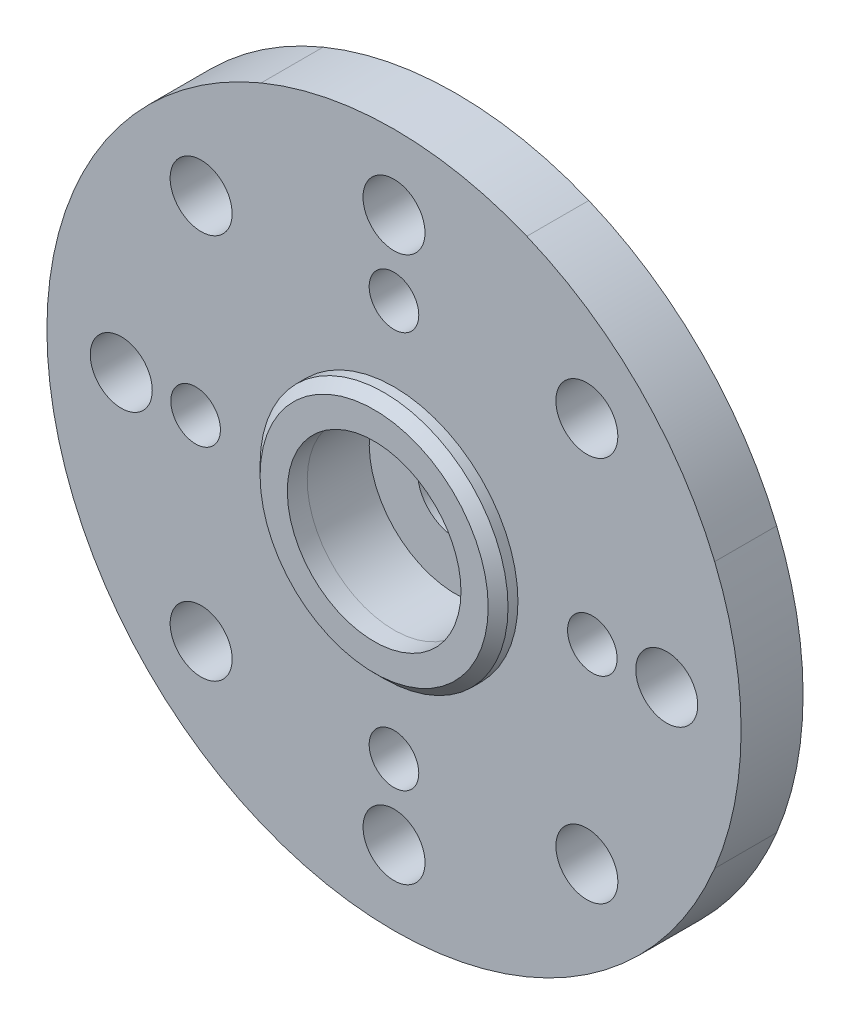
ISO-10303-21;
HEADER;
FILE_DESCRIPTION(('STEP AP214'),'2;1');
FILE_NAME('part.step','',(''),(''),'','','');
FILE_SCHEMA(('AUTOMOTIVE_DESIGN { 1 0 10303 214 1 1 1 1 }'));
ENDSEC;
DATA;
#1=APPLICATION_CONTEXT('core data for automotive mechanical design processes');
#2=APPLICATION_PROTOCOL_DEFINITION('international standard','automotive_design',2000,#1);
#3=PRODUCT_CONTEXT('',#1,'mechanical');
#4=PRODUCT('Part','Part','',(#3));
#5=PRODUCT_RELATED_PRODUCT_CATEGORY('part','',(#4));
#6=PRODUCT_DEFINITION_FORMATION('','',#4);
#7=PRODUCT_DEFINITION_CONTEXT('part definition',#1,'design');
#8=PRODUCT_DEFINITION('design','',#6,#7);
#9=PRODUCT_DEFINITION_SHAPE('','',#8);
#10=(LENGTH_UNIT() NAMED_UNIT(*) SI_UNIT(.MILLI.,.METRE.));
#11=(NAMED_UNIT(*) PLANE_ANGLE_UNIT() SI_UNIT($,.RADIAN.));
#12=(NAMED_UNIT(*) SI_UNIT($,.STERADIAN.) SOLID_ANGLE_UNIT());
#13=UNCERTAINTY_MEASURE_WITH_UNIT(LENGTH_MEASURE(1.E-05),#10,'distance_accuracy_value','');
#14=(GEOMETRIC_REPRESENTATION_CONTEXT(3) GLOBAL_UNCERTAINTY_ASSIGNED_CONTEXT((#13)) GLOBAL_UNIT_ASSIGNED_CONTEXT((#10,
#11,#12)) REPRESENTATION_CONTEXT('',''));
#15=CARTESIAN_POINT('',(0.,0.,0.));
#16=DIRECTION('',(0.,0.,1.));
#17=DIRECTION('',(1.,0.,0.));
#18=AXIS2_PLACEMENT_3D('',#15,#16,#17);
#19=CARTESIAN_POINT('',(0.,0.,0.));
#20=DIRECTION('',(0.,0.,1.));
#21=DIRECTION('',(1.,0.,0.));
#22=AXIS2_PLACEMENT_3D('',#19,#20,#21);
#23=PLANE('',#22);
#24=CARTESIAN_POINT('',(-10.9989999545496,-0.00099995454132478,0.));
#25=DIRECTION('',(0.,0.,1.));
#26=DIRECTION('',(1.,0.,0.));
#27=AXIS2_PLACEMENT_3D('',#24,#25,#26);
#28=CIRCLE('',#27,1.25);
#29=CARTESIAN_POINT('',(-9.74899995454959,-0.00099995454132478,0.));
#30=VERTEX_POINT('',#29);
#31=EDGE_CURVE('E197',#30,#30,#28,.T.);
#32=ORIENTED_EDGE('',*,*,#31,.T.);
#33=EDGE_LOOP('',(#32));
#34=FACE_BOUND('',#33,.T.);
#35=CARTESIAN_POINT('',(-7.77646745413667,-7.77888162223453,0.));
#36=DIRECTION('',(0.,0.,1.));
#37=DIRECTION('',(1.,0.,0.));
#38=AXIS2_PLACEMENT_3D('',#35,#36,#37);
#39=CIRCLE('',#38,1.25);
#40=CARTESIAN_POINT('',(-6.52646745413667,-7.77888162223453,0.));
#41=VERTEX_POINT('',#40);
#42=EDGE_CURVE('E194',#41,#41,#39,.T.);
#43=ORIENTED_EDGE('',*,*,#42,.T.);
#44=EDGE_LOOP('',(#43));
#45=FACE_BOUND('',#44,.T.);
#46=CARTESIAN_POINT('',(-7.7778816676932,7.77746749958708,0.));
#47=DIRECTION('',(0.,0.,1.));
#48=DIRECTION('',(1.,0.,0.));
#49=AXIS2_PLACEMENT_3D('',#46,#47,#48);
#50=CIRCLE('',#49,1.25);
#51=CARTESIAN_POINT('',(-6.5278816676932,7.77746749958708,0.));
#52=VERTEX_POINT('',#51);
#53=EDGE_CURVE('E191',#52,#52,#50,.T.);
#54=ORIENTED_EDGE('',*,*,#53,.T.);
#55=EDGE_LOOP('',(#54));
#56=FACE_BOUND('',#55,.T.);
#57=CARTESIAN_POINT('',(-7.99999999999981,-1.95040837110594E-13,0.));
#58=DIRECTION('',(0.,0.,1.));
#59=DIRECTION('',(1.,0.,0.));
#60=AXIS2_PLACEMENT_3D('',#57,#58,#59);
#61=CIRCLE('',#60,1.);
#62=CARTESIAN_POINT('',(-6.99999999999981,-1.95040837110594E-13,0.));
#63=VERTEX_POINT('',#62);
#64=EDGE_CURVE('E188',#63,#63,#61,.T.);
#65=ORIENTED_EDGE('',*,*,#64,.T.);
#66=EDGE_LOOP('',(#65));
#67=FACE_BOUND('',#66,.T.);
#68=CARTESIAN_POINT('',(0.00100004545041241,-0.000999954541323126,0.));
#69=DIRECTION('',(0.,0.,1.));
#70=DIRECTION('',(1.,0.,0.));
#71=AXIS2_PLACEMENT_3D('',#68,#69,#70);
#72=CIRCLE('',#71,14.);
#73=CARTESIAN_POINT('',(5.35762660762039,12.9337034387899,0.));
#74=VERTEX_POINT('',#73);
#75=CARTESIAN_POINT('',(-5.35666620819831,12.9332728241855,0.));
#76=VERTEX_POINT('',#75);
#77=EDGE_CURVE('E174',#74,#76,#72,.T.);
#78=ORIENTED_EDGE('',*,*,#77,.F.);
#79=CARTESIAN_POINT('',(0.000292925358819902,-0.000707093464936729,0.));
#80=DIRECTION('',(0.,0.,1.));
#81=DIRECTION('',(1.,0.,0.));
#82=AXIS2_PLACEMENT_3D('',#79,#80,#81);
#83=CIRCLE('',#82,14.);
#84=CARTESIAN_POINT('',(12.9342163738387,5.35780242214324,0.));
#85=VERTEX_POINT('',#84);
#86=EDGE_CURVE('E87',#85,#74,#83,.T.);
#87=ORIENTED_EDGE('',*,*,#86,.F.);
#88=CARTESIAN_POINT('',(0.,0.,0.));
#89=DIRECTION('',(0.,0.,1.));
#90=DIRECTION('',(1.,0.,0.));
#91=AXIS2_PLACEMENT_3D('',#88,#89,#90);
#92=CIRCLE('',#91,14.);
#93=CARTESIAN_POINT('',(12.9347033933191,-5.3566265621993,0.));
#94=VERTEX_POINT('',#93);
#95=EDGE_CURVE('E81',#94,#85,#92,.T.);
#96=ORIENTED_EDGE('',*,*,#95,.F.);
#97=CARTESIAN_POINT('',(0.000292861076386398,0.000707120091592508,0.));
#98=DIRECTION('',(0.,0.,1.));
#99=DIRECTION('',(1.,0.,0.));
#100=AXIS2_PLACEMENT_3D('',#97,#98,#99);
#101=CIRCLE('',#100,14.);
#102=CARTESIAN_POINT('',(5.35880237671388,-12.9332163283761,0.));
#103=VERTEX_POINT('',#102);
#104=EDGE_CURVE('E124',#103,#94,#101,.T.);
#105=ORIENTED_EDGE('',*,*,#104,.F.);
#106=CARTESIAN_POINT('',(0.000999954541323126,0.00100004545041241,0.));
#107=DIRECTION('',(0.,0.,1.));
#108=DIRECTION('',(1.,0.,0.));
#109=AXIS2_PLACEMENT_3D('',#106,#107,#108);
#110=CIRCLE('',#109,14.);
#111=CARTESIAN_POINT('',(-5.35562660765797,-12.9337033478687,0.));
#112=VERTEX_POINT('',#111);
#113=EDGE_CURVE('E183',#112,#103,#110,.T.);
#114=ORIENTED_EDGE('',*,*,#113,.F.);
#115=CARTESIAN_POINT('',(0.00170707463291564,0.000707184374026013,0.));
#116=DIRECTION('',(0.,0.,1.));
#117=DIRECTION('',(1.,0.,0.));
#118=AXIS2_PLACEMENT_3D('',#115,#116,#117);
#119=CIRCLE('',#118,14.);
#120=CARTESIAN_POINT('',(-12.9322163738348,-5.35780233126346,0.));
#121=VERTEX_POINT('',#120);
#122=EDGE_CURVE('E181',#121,#112,#119,.T.);
#123=ORIENTED_EDGE('',*,*,#122,.F.);
#124=CARTESIAN_POINT('',(0.00199999999173554,9.09090892843415E-08,0.));
#125=DIRECTION('',(0.,0.,1.));
#126=DIRECTION('',(1.,0.,0.));
#127=AXIS2_PLACEMENT_3D('',#124,#125,#126);
#128=CIRCLE('',#127,14.);
#129=CARTESIAN_POINT('',(-12.9327597858485,5.35649047945739,0.));
#130=VERTEX_POINT('',#129);
#131=EDGE_CURVE('E179',#130,#121,#128,.T.);
#132=ORIENTED_EDGE('',*,*,#131,.F.);
#133=CARTESIAN_POINT('',(0.00170713891534914,-0.000707029182503224,0.));
#134=DIRECTION('',(0.,0.,1.));
#135=DIRECTION('',(1.,0.,0.));
#136=AXIS2_PLACEMENT_3D('',#133,#134,#135);
#137=CIRCLE('',#136,13.9999999919424);
#138=EDGE_CURVE('E177',#76,#130,#137,.T.);
#139=ORIENTED_EDGE('',*,*,#138,.F.);
#140=EDGE_LOOP('',(#78,#87,#96,#105,#114,#123,#132,#139));
#141=FACE_BOUND('',#140,.T.);
#142=CARTESIAN_POINT('',(8.00000000000019,1.94061119671276E-13,0.));
#143=DIRECTION('',(0.,0.,1.));
#144=DIRECTION('',(1.,0.,0.));
#145=AXIS2_PLACEMENT_3D('',#142,#143,#144);
#146=CIRCLE('',#145,1.);
#147=CARTESIAN_POINT('',(9.0000000000002,1.94061119671276E-13,0.));
#148=VERTEX_POINT('',#147);
#149=EDGE_CURVE('E171',#148,#148,#146,.T.);
#150=ORIENTED_EDGE('',*,*,#149,.T.);
#151=EDGE_LOOP('',(#150));
#152=FACE_BOUND('',#151,.T.);
#153=CARTESIAN_POINT('',(7.77988166768494,-7.777467408678,0.));
#154=DIRECTION('',(0.,0.,1.));
#155=DIRECTION('',(1.,0.,0.));
#156=AXIS2_PLACEMENT_3D('',#153,#154,#155);
#157=CIRCLE('',#156,1.25000000805759);
#158=CARTESIAN_POINT('',(9.02988167574254,-7.777467408678,0.));
#159=VERTEX_POINT('',#158);
#160=EDGE_CURVE('E168',#159,#159,#157,.T.);
#161=ORIENTED_EDGE('',*,*,#160,.T.);
#162=EDGE_LOOP('',(#161));
#163=FACE_BOUND('',#162,.T.);
#164=CARTESIAN_POINT('',(7.77846745412841,7.77888171314361,0.));
#165=DIRECTION('',(0.,0.,1.));
#166=DIRECTION('',(1.,0.,0.));
#167=AXIS2_PLACEMENT_3D('',#164,#165,#166);
#168=CIRCLE('',#167,1.25);
#169=CARTESIAN_POINT('',(9.02846745412841,7.77888171314361,0.));
#170=VERTEX_POINT('',#169);
#171=EDGE_CURVE('E165',#170,#170,#168,.T.);
#172=ORIENTED_EDGE('',*,*,#171,.T.);
#173=EDGE_LOOP('',(#172));
#174=FACE_BOUND('',#173,.T.);
#175=CARTESIAN_POINT('',(11.0009999545413,0.00100004545041272,0.));
#176=DIRECTION('',(0.,0.,1.));
#177=DIRECTION('',(1.,0.,0.));
#178=AXIS2_PLACEMENT_3D('',#175,#176,#177);
#179=CIRCLE('',#178,1.25);
#180=CARTESIAN_POINT('',(12.2509999545413,0.00100004545041272,0.));
#181=VERTEX_POINT('',#180);
#182=EDGE_CURVE('E162',#181,#181,#179,.T.);
#183=ORIENTED_EDGE('',*,*,#182,.T.);
#184=EDGE_LOOP('',(#183));
#185=FACE_BOUND('',#184,.T.);
#186=CARTESIAN_POINT('',(0.00199999999173652,-10.9999999090909,0.));
#187=DIRECTION('',(0.,0.,1.));
#188=DIRECTION('',(1.,0.,0.));
#189=AXIS2_PLACEMENT_3D('',#186,#187,#188);
#190=CIRCLE('',#189,1.25);
#191=CARTESIAN_POINT('',(1.25199999999174,-10.9999999090909,0.));
#192=VERTEX_POINT('',#191);
#193=EDGE_CURVE('E159',#192,#192,#190,.T.);
#194=ORIENTED_EDGE('',*,*,#193,.T.);
#195=EDGE_LOOP('',(#194));
#196=FACE_BOUND('',#195,.T.);
#197=CARTESIAN_POINT('',(3.8885702742204E-13,-8.,0.));
#198=DIRECTION('',(0.,0.,1.));
#199=DIRECTION('',(1.,0.,0.));
#200=AXIS2_PLACEMENT_3D('',#197,#198,#199);
#201=CIRCLE('',#200,1.);
#202=CARTESIAN_POINT('',(1.00000000000039,-8.,0.));
#203=VERTEX_POINT('',#202);
#204=EDGE_CURVE('E156',#203,#203,#201,.T.);
#205=ORIENTED_EDGE('',*,*,#204,.T.);
#206=EDGE_LOOP('',(#205));
#207=FACE_BOUND('',#206,.T.);
#208=CARTESIAN_POINT('',(0.,8.,0.));
#209=DIRECTION('',(0.,0.,1.));
#210=DIRECTION('',(1.,0.,0.));
#211=AXIS2_PLACEMENT_3D('',#208,#209,#210);
#212=CIRCLE('',#211,1.);
#213=CARTESIAN_POINT('',(1.,8.,0.));
#214=VERTEX_POINT('',#213);
#215=EDGE_CURVE('E149',#214,#214,#212,.T.);
#216=ORIENTED_EDGE('',*,*,#215,.T.);
#217=EDGE_LOOP('',(#216));
#218=FACE_BOUND('',#217,.T.);
#219=CARTESIAN_POINT('',(0.,11.,0.));
#220=DIRECTION('',(0.,0.,1.));
#221=DIRECTION('',(1.,0.,0.));
#222=AXIS2_PLACEMENT_3D('',#219,#220,#221);
#223=CIRCLE('',#222,1.25);
#224=CARTESIAN_POINT('',(1.25,11.,0.));
#225=VERTEX_POINT('',#224);
#226=EDGE_CURVE('E146',#225,#225,#223,.T.);
#227=ORIENTED_EDGE('',*,*,#226,.T.);
#228=EDGE_LOOP('',(#227));
#229=FACE_BOUND('',#228,.T.);
#230=CARTESIAN_POINT('',(0.,0.,0.));
#231=DIRECTION('',(0.,0.,1.));
#232=DIRECTION('',(1.,0.,0.));
#233=AXIS2_PLACEMENT_3D('',#230,#231,#232);
#234=CIRCLE('',#233,5.);
#235=CARTESIAN_POINT('',(5.,0.,0.));
#236=VERTEX_POINT('',#235);
#237=EDGE_CURVE('E215',#236,#236,#234,.F.);
#238=ORIENTED_EDGE('',*,*,#237,.F.);
#239=EDGE_LOOP('',(#238));
#240=FACE_BOUND('',#239,.T.);
#241=ADVANCED_FACE('F35',(#34,#45,#56,#67,#141,#152,#163,#174,#185,#196,#207,#218,#229,#240),
#23,.F.);
#242=CARTESIAN_POINT('',(0.00100004545041241,-0.000999954541323126,2.5));
#243=DIRECTION('',(0.,0.,-1.));
#244=DIRECTION('',(-1.,0.,0.));
#245=AXIS2_PLACEMENT_3D('',#242,#243,#244);
#246=CYLINDRICAL_SURFACE('',#245,14.);
#247=ORIENTED_EDGE('',*,*,#77,.T.);
#248=DIRECTION('',(0.,0.,-1.));
#249=VECTOR('',#248,1.);
#250=CARTESIAN_POINT('',(-5.35666620819831,12.9332728241855,2.5));
#251=LINE('',#250,#249);
#252=CARTESIAN_POINT('',(-5.35666620819831,12.9332728241855,2.5));
#253=VERTEX_POINT('',#252);
#254=EDGE_CURVE('E213',#253,#76,#251,.T.);
#255=ORIENTED_EDGE('',*,*,#254,.F.);
#256=CARTESIAN_POINT('',(0.00100004545041241,-0.000999954541323126,2.5));
#257=DIRECTION('',(0.,0.,1.));
#258=DIRECTION('',(1.,0.,0.));
#259=AXIS2_PLACEMENT_3D('',#256,#257,#258);
#260=CIRCLE('',#259,14.);
#261=CARTESIAN_POINT('',(5.35762660762039,12.9337034387899,2.5));
#262=VERTEX_POINT('',#261);
#263=EDGE_CURVE('E408',#262,#253,#260,.T.);
#264=ORIENTED_EDGE('',*,*,#263,.F.);
#265=DIRECTION('',(0.,0.,-1.));
#266=VECTOR('',#265,1.);
#267=CARTESIAN_POINT('',(5.35762660762039,12.9337034387899,2.5));
#268=LINE('',#267,#266);
#269=EDGE_CURVE('E145',#262,#74,#268,.T.);
#270=ORIENTED_EDGE('',*,*,#269,.T.);
#271=EDGE_LOOP('',(#247,#255,#264,#270));
#272=FACE_BOUND('',#271,.T.);
#273=ADVANCED_FACE('F254',(#272),#246,.T.);
#274=CARTESIAN_POINT('',(0.00170713891534914,-0.000707029182503224,2.5));
#275=DIRECTION('',(0.,0.,-1.));
#276=DIRECTION('',(-1.,0.,0.));
#277=AXIS2_PLACEMENT_3D('',#274,#275,#276);
#278=CYLINDRICAL_SURFACE('',#277,13.9999999919424);
#279=ORIENTED_EDGE('',*,*,#138,.T.);
#280=DIRECTION('',(0.,0.,-1.));
#281=VECTOR('',#280,1.);
#282=CARTESIAN_POINT('',(-12.9327597858485,5.35649047945739,2.5));
#283=LINE('',#282,#281);
#284=CARTESIAN_POINT('',(-12.9327597858485,5.35649047945739,2.5));
#285=VERTEX_POINT('',#284);
#286=EDGE_CURVE('E210',#285,#130,#283,.T.);
#287=ORIENTED_EDGE('',*,*,#286,.F.);
#288=CARTESIAN_POINT('',(0.00170713891534914,-0.000707029182503224,2.5));
#289=DIRECTION('',(0.,0.,1.));
#290=DIRECTION('',(1.,0.,0.));
#291=AXIS2_PLACEMENT_3D('',#288,#289,#290);
#292=CIRCLE('',#291,13.9999999919424);
#293=EDGE_CURVE('E96',#253,#285,#292,.T.);
#294=ORIENTED_EDGE('',*,*,#293,.F.);
#295=ORIENTED_EDGE('',*,*,#254,.T.);
#296=EDGE_LOOP('',(#279,#287,#294,#295));
#297=FACE_BOUND('',#296,.T.);
#298=ADVANCED_FACE('F260',(#297),#278,.T.);
#299=CARTESIAN_POINT('',(0.00199999999173554,9.09090892843415E-08,2.5));
#300=DIRECTION('',(0.,0.,-1.));
#301=DIRECTION('',(-1.,0.,0.));
#302=AXIS2_PLACEMENT_3D('',#299,#300,#301);
#303=CYLINDRICAL_SURFACE('',#302,14.);
#304=ORIENTED_EDGE('',*,*,#131,.T.);
#305=DIRECTION('',(0.,0.,-1.));
#306=VECTOR('',#305,1.);
#307=CARTESIAN_POINT('',(-12.9322163738348,-5.35780233126346,2.5));
#308=LINE('',#307,#306);
#309=CARTESIAN_POINT('',(-12.9322163738348,-5.35780233126346,2.5));
#310=VERTEX_POINT('',#309);
#311=EDGE_CURVE('E207',#310,#121,#308,.T.);
#312=ORIENTED_EDGE('',*,*,#311,.F.);
#313=CARTESIAN_POINT('',(0.00199999999173554,9.09090892843415E-08,2.5));
#314=DIRECTION('',(0.,0.,1.));
#315=DIRECTION('',(1.,0.,0.));
#316=AXIS2_PLACEMENT_3D('',#313,#314,#315);
#317=CIRCLE('',#316,14.);
#318=EDGE_CURVE('E411',#285,#310,#317,.T.);
#319=ORIENTED_EDGE('',*,*,#318,.F.);
#320=ORIENTED_EDGE('',*,*,#286,.T.);
#321=EDGE_LOOP('',(#304,#312,#319,#320));
#322=FACE_BOUND('',#321,.T.);
#323=ADVANCED_FACE('F294',(#322),#303,.T.);
#324=CARTESIAN_POINT('',(0.00170707463291564,0.000707184374026013,2.5));
#325=DIRECTION('',(0.,0.,-1.));
#326=DIRECTION('',(-1.,0.,0.));
#327=AXIS2_PLACEMENT_3D('',#324,#325,#326);
#328=CYLINDRICAL_SURFACE('',#327,14.);
#329=ORIENTED_EDGE('',*,*,#122,.T.);
#330=DIRECTION('',(0.,0.,-1.));
#331=VECTOR('',#330,1.);
#332=CARTESIAN_POINT('',(-5.35562660765797,-12.9337033478687,2.5));
#333=LINE('',#332,#331);
#334=CARTESIAN_POINT('',(-5.35562660765797,-12.9337033478687,2.5));
#335=VERTEX_POINT('',#334);
#336=EDGE_CURVE('E204',#335,#112,#333,.T.);
#337=ORIENTED_EDGE('',*,*,#336,.F.);
#338=CARTESIAN_POINT('',(0.00170707463291564,0.000707184374026013,2.5));
#339=DIRECTION('',(0.,0.,1.));
#340=DIRECTION('',(1.,0.,0.));
#341=AXIS2_PLACEMENT_3D('',#338,#339,#340);
#342=CIRCLE('',#341,14.);
#343=EDGE_CURVE('E413',#310,#335,#342,.T.);
#344=ORIENTED_EDGE('',*,*,#343,.F.);
#345=ORIENTED_EDGE('',*,*,#311,.T.);
#346=EDGE_LOOP('',(#329,#337,#344,#345));
#347=FACE_BOUND('',#346,.T.);
#348=ADVANCED_FACE('F290',(#347),#328,.T.);
#349=CARTESIAN_POINT('',(0.000999954541323126,0.00100004545041241,2.5));
#350=DIRECTION('',(0.,0.,-1.));
#351=DIRECTION('',(-1.,0.,0.));
#352=AXIS2_PLACEMENT_3D('',#349,#350,#351);
#353=CYLINDRICAL_SURFACE('',#352,14.);
#354=ORIENTED_EDGE('',*,*,#113,.T.);
#355=DIRECTION('',(0.,0.,-1.));
#356=VECTOR('',#355,1.);
#357=CARTESIAN_POINT('',(5.35880237671388,-12.9332163283761,2.5));
#358=LINE('',#357,#356);
#359=CARTESIAN_POINT('',(5.35880237671388,-12.9332163283761,2.5));
#360=VERTEX_POINT('',#359);
#361=EDGE_CURVE('E125',#360,#103,#358,.T.);
#362=ORIENTED_EDGE('',*,*,#361,.F.);
#363=CARTESIAN_POINT('',(0.000999954541323126,0.00100004545041241,2.5));
#364=DIRECTION('',(0.,0.,1.));
#365=DIRECTION('',(1.,0.,0.));
#366=AXIS2_PLACEMENT_3D('',#363,#364,#365);
#367=CIRCLE('',#366,14.);
#368=EDGE_CURVE('E116',#335,#360,#367,.T.);
#369=ORIENTED_EDGE('',*,*,#368,.F.);
#370=ORIENTED_EDGE('',*,*,#336,.T.);
#371=EDGE_LOOP('',(#354,#362,#369,#370));
#372=FACE_BOUND('',#371,.T.);
#373=ADVANCED_FACE('F287',(#372),#353,.T.);
#374=CARTESIAN_POINT('',(0.000292861076386398,0.000707120091592508,2.5));
#375=DIRECTION('',(0.,0.,-1.));
#376=DIRECTION('',(-1.,0.,0.));
#377=AXIS2_PLACEMENT_3D('',#374,#375,#376);
#378=CYLINDRICAL_SURFACE('',#377,14.);
#379=ORIENTED_EDGE('',*,*,#104,.T.);
#380=DIRECTION('',(0.,0.,-1.));
#381=VECTOR('',#380,1.);
#382=CARTESIAN_POINT('',(12.9347033933191,-5.3566265621993,2.5));
#383=LINE('',#382,#381);
#384=CARTESIAN_POINT('',(12.9347033933191,-5.3566265621993,2.5));
#385=VERTEX_POINT('',#384);
#386=EDGE_CURVE('E121',#385,#94,#383,.T.);
#387=ORIENTED_EDGE('',*,*,#386,.F.);
#388=CARTESIAN_POINT('',(0.000292861076386398,0.000707120091592508,2.5));
#389=DIRECTION('',(0.,0.,1.));
#390=DIRECTION('',(1.,0.,0.));
#391=AXIS2_PLACEMENT_3D('',#388,#389,#390);
#392=CIRCLE('',#391,14.);
#393=EDGE_CURVE('E109',#360,#385,#392,.T.);
#394=ORIENTED_EDGE('',*,*,#393,.F.);
#395=ORIENTED_EDGE('',*,*,#361,.T.);
#396=EDGE_LOOP('',(#379,#387,#394,#395));
#397=FACE_BOUND('',#396,.T.);
#398=ADVANCED_FACE('F122',(#397),#378,.T.);
#399=CARTESIAN_POINT('',(0.,0.,2.5));
#400=DIRECTION('',(0.,0.,-1.));
#401=DIRECTION('',(-1.,0.,0.));
#402=AXIS2_PLACEMENT_3D('',#399,#400,#401);
#403=CYLINDRICAL_SURFACE('',#402,14.);
#404=ORIENTED_EDGE('',*,*,#95,.T.);
#405=DIRECTION('',(0.,0.,-1.));
#406=VECTOR('',#405,1.);
#407=CARTESIAN_POINT('',(12.9342163738387,5.35780242214324,2.5));
#408=LINE('',#407,#406);
#409=CARTESIAN_POINT('',(12.9342163738387,5.35780242214324,2.5));
#410=VERTEX_POINT('',#409);
#411=EDGE_CURVE('E126',#410,#85,#408,.T.);
#412=ORIENTED_EDGE('',*,*,#411,.F.);
#413=CARTESIAN_POINT('',(0.,0.,2.5));
#414=DIRECTION('',(0.,0.,1.));
#415=DIRECTION('',(1.,0.,0.));
#416=AXIS2_PLACEMENT_3D('',#413,#414,#415);
#417=CIRCLE('',#416,14.);
#418=EDGE_CURVE('E114',#385,#410,#417,.T.);
#419=ORIENTED_EDGE('',*,*,#418,.F.);
#420=ORIENTED_EDGE('',*,*,#386,.T.);
#421=EDGE_LOOP('',(#404,#412,#419,#420));
#422=FACE_BOUND('',#421,.T.);
#423=ADVANCED_FACE('F128',(#422),#403,.T.);
#424=CARTESIAN_POINT('',(-7.77646745413667,-7.77888162223453,2.5));
#425=DIRECTION('',(0.,0.,-1.));
#426=DIRECTION('',(-1.,0.,0.));
#427=AXIS2_PLACEMENT_3D('',#424,#425,#426);
#428=CYLINDRICAL_SURFACE('',#427,1.25);
#429=CARTESIAN_POINT('',(-7.77646745413667,-7.77888162223453,2.5));
#430=DIRECTION('',(0.,0.,1.));
#431=DIRECTION('',(1.,0.,0.));
#432=AXIS2_PLACEMENT_3D('',#429,#430,#431);
#433=CIRCLE('',#432,1.25);
#434=CARTESIAN_POINT('',(-6.52646745413667,-7.77888162223453,2.5));
#435=VERTEX_POINT('',#434);
#436=EDGE_CURVE('E139',#435,#435,#433,.T.);
#437=ORIENTED_EDGE('',*,*,#436,.T.);
#438=EDGE_LOOP('',(#437));
#439=FACE_BOUND('',#438,.T.);
#440=ORIENTED_EDGE('',*,*,#42,.F.);
#441=EDGE_LOOP('',(#440));
#442=FACE_BOUND('',#441,.T.);
#443=ADVANCED_FACE('F267',(#439,#442),#428,.F.);
#444=CARTESIAN_POINT('',(-7.7778816676932,7.77746749958708,2.5));
#445=DIRECTION('',(0.,0.,-1.));
#446=DIRECTION('',(-1.,0.,0.));
#447=AXIS2_PLACEMENT_3D('',#444,#445,#446);
#448=CYLINDRICAL_SURFACE('',#447,1.25);
#449=CARTESIAN_POINT('',(-7.7778816676932,7.77746749958708,2.5));
#450=DIRECTION('',(0.,0.,1.));
#451=DIRECTION('',(1.,0.,0.));
#452=AXIS2_PLACEMENT_3D('',#449,#450,#451);
#453=CIRCLE('',#452,1.25);
#454=CARTESIAN_POINT('',(-6.5278816676932,7.77746749958708,2.5));
#455=VERTEX_POINT('',#454);
#456=EDGE_CURVE('E136',#455,#455,#453,.T.);
#457=ORIENTED_EDGE('',*,*,#456,.T.);
#458=EDGE_LOOP('',(#457));
#459=FACE_BOUND('',#458,.T.);
#460=ORIENTED_EDGE('',*,*,#53,.F.);
#461=EDGE_LOOP('',(#460));
#462=FACE_BOUND('',#461,.T.);
#463=ADVANCED_FACE('F270',(#459,#462),#448,.F.);
#464=CARTESIAN_POINT('',(-7.99999999999981,-1.95040837110594E-13,2.5));
#465=DIRECTION('',(0.,0.,-1.));
#466=DIRECTION('',(-1.,0.,0.));
#467=AXIS2_PLACEMENT_3D('',#464,#465,#466);
#468=CYLINDRICAL_SURFACE('',#467,1.);
#469=CARTESIAN_POINT('',(-7.99999999999981,-1.95040837110594E-13,2.5));
#470=DIRECTION('',(0.,0.,1.));
#471=DIRECTION('',(1.,0.,0.));
#472=AXIS2_PLACEMENT_3D('',#469,#470,#471);
#473=CIRCLE('',#472,1.);
#474=CARTESIAN_POINT('',(-6.99999999999981,-1.95040837110594E-13,2.5));
#475=VERTEX_POINT('',#474);
#476=EDGE_CURVE('E130',#475,#475,#473,.T.);
#477=ORIENTED_EDGE('',*,*,#476,.T.);
#478=EDGE_LOOP('',(#477));
#479=FACE_BOUND('',#478,.T.);
#480=ORIENTED_EDGE('',*,*,#64,.F.);
#481=EDGE_LOOP('',(#480));
#482=FACE_BOUND('',#481,.T.);
#483=ADVANCED_FACE('F274',(#479,#482),#468,.F.);
#484=CARTESIAN_POINT('',(0.000292925358819902,-0.000707093464936729,2.5));
#485=DIRECTION('',(0.,0.,-1.));
#486=DIRECTION('',(-1.,0.,0.));
#487=AXIS2_PLACEMENT_3D('',#484,#485,#486);
#488=CYLINDRICAL_SURFACE('',#487,14.);
#489=ORIENTED_EDGE('',*,*,#86,.T.);
#490=ORIENTED_EDGE('',*,*,#269,.F.);
#491=CARTESIAN_POINT('',(0.000292925358819902,-0.000707093464936729,2.5));
#492=DIRECTION('',(0.,0.,1.));
#493=DIRECTION('',(1.,0.,0.));
#494=AXIS2_PLACEMENT_3D('',#491,#492,#493);
#495=CIRCLE('',#494,14.);
#496=EDGE_CURVE('E52',#410,#262,#495,.T.);
#497=ORIENTED_EDGE('',*,*,#496,.F.);
#498=ORIENTED_EDGE('',*,*,#411,.T.);
#499=EDGE_LOOP('',(#489,#490,#497,#498));
#500=FACE_BOUND('',#499,.T.);
#501=ADVANCED_FACE('F278',(#500),#488,.T.);
#502=CARTESIAN_POINT('',(8.00000000000019,1.94061119671276E-13,2.5));
#503=DIRECTION('',(0.,0.,-1.));
#504=DIRECTION('',(-1.,0.,0.));
#505=AXIS2_PLACEMENT_3D('',#502,#503,#504);
#506=CYLINDRICAL_SURFACE('',#505,1.);
#507=CARTESIAN_POINT('',(8.00000000000019,1.94061119671276E-13,2.5));
#508=DIRECTION('',(0.,0.,1.));
#509=DIRECTION('',(1.,0.,0.));
#510=AXIS2_PLACEMENT_3D('',#507,#508,#509);
#511=CIRCLE('',#510,1.);
#512=CARTESIAN_POINT('',(9.0000000000002,1.94061119671276E-13,2.5));
#513=VERTEX_POINT('',#512);
#514=EDGE_CURVE('E405',#513,#513,#511,.T.);
#515=ORIENTED_EDGE('',*,*,#514,.T.);
#516=EDGE_LOOP('',(#515));
#517=FACE_BOUND('',#516,.T.);
#518=ORIENTED_EDGE('',*,*,#149,.F.);
#519=EDGE_LOOP('',(#518));
#520=FACE_BOUND('',#519,.T.);
#521=ADVANCED_FACE('F282',(#517,#520),#506,.F.);
#522=CARTESIAN_POINT('',(7.77988166768494,-7.777467408678,2.5));
#523=DIRECTION('',(0.,0.,-1.));
#524=DIRECTION('',(-1.,0.,0.));
#525=AXIS2_PLACEMENT_3D('',#522,#523,#524);
#526=CYLINDRICAL_SURFACE('',#525,1.25000000805759);
#527=CARTESIAN_POINT('',(7.77988166768494,-7.777467408678,2.5));
#528=DIRECTION('',(0.,0.,1.));
#529=DIRECTION('',(1.,0.,0.));
#530=AXIS2_PLACEMENT_3D('',#527,#528,#529);
#531=CIRCLE('',#530,1.25000000805759);
#532=CARTESIAN_POINT('',(9.02988167574254,-7.777467408678,2.5));
#533=VERTEX_POINT('',#532);
#534=EDGE_CURVE('E402',#533,#533,#531,.T.);
#535=ORIENTED_EDGE('',*,*,#534,.T.);
#536=EDGE_LOOP('',(#535));
#537=FACE_BOUND('',#536,.T.);
#538=ORIENTED_EDGE('',*,*,#160,.F.);
#539=EDGE_LOOP('',(#538));
#540=FACE_BOUND('',#539,.T.);
#541=ADVANCED_FACE('F303',(#537,#540),#526,.F.);
#542=CARTESIAN_POINT('',(7.77846745412841,7.77888171314361,2.5));
#543=DIRECTION('',(0.,0.,-1.));
#544=DIRECTION('',(-1.,0.,0.));
#545=AXIS2_PLACEMENT_3D('',#542,#543,#544);
#546=CYLINDRICAL_SURFACE('',#545,1.25);
#547=CARTESIAN_POINT('',(7.77846745412841,7.77888171314361,2.5));
#548=DIRECTION('',(0.,0.,1.));
#549=DIRECTION('',(1.,0.,0.));
#550=AXIS2_PLACEMENT_3D('',#547,#548,#549);
#551=CIRCLE('',#550,1.25);
#552=CARTESIAN_POINT('',(9.02846745412841,7.77888171314361,2.5));
#553=VERTEX_POINT('',#552);
#554=EDGE_CURVE('E399',#553,#553,#551,.T.);
#555=ORIENTED_EDGE('',*,*,#554,.T.);
#556=EDGE_LOOP('',(#555));
#557=FACE_BOUND('',#556,.T.);
#558=ORIENTED_EDGE('',*,*,#171,.F.);
#559=EDGE_LOOP('',(#558));
#560=FACE_BOUND('',#559,.T.);
#561=ADVANCED_FACE('F307',(#557,#560),#546,.F.);
#562=CARTESIAN_POINT('',(11.0009999545413,0.00100004545041272,2.5));
#563=DIRECTION('',(0.,0.,-1.));
#564=DIRECTION('',(-1.,0.,0.));
#565=AXIS2_PLACEMENT_3D('',#562,#563,#564);
#566=CYLINDRICAL_SURFACE('',#565,1.25);
#567=CARTESIAN_POINT('',(11.0009999545413,0.00100004545041272,2.5));
#568=DIRECTION('',(0.,0.,1.));
#569=DIRECTION('',(1.,0.,0.));
#570=AXIS2_PLACEMENT_3D('',#567,#568,#569);
#571=CIRCLE('',#570,1.25);
#572=CARTESIAN_POINT('',(12.2509999545413,0.00100004545041272,2.5));
#573=VERTEX_POINT('',#572);
#574=EDGE_CURVE('E396',#573,#573,#571,.T.);
#575=ORIENTED_EDGE('',*,*,#574,.T.);
#576=EDGE_LOOP('',(#575));
#577=FACE_BOUND('',#576,.T.);
#578=ORIENTED_EDGE('',*,*,#182,.F.);
#579=EDGE_LOOP('',(#578));
#580=FACE_BOUND('',#579,.T.);
#581=ADVANCED_FACE('F311',(#577,#580),#566,.F.);
#582=CARTESIAN_POINT('',(0.00199999999173652,-10.9999999090909,2.5));
#583=DIRECTION('',(0.,0.,-1.));
#584=DIRECTION('',(-1.,0.,0.));
#585=AXIS2_PLACEMENT_3D('',#582,#583,#584);
#586=CYLINDRICAL_SURFACE('',#585,1.25);
#587=CARTESIAN_POINT('',(0.00199999999173652,-10.9999999090909,2.5));
#588=DIRECTION('',(0.,0.,1.));
#589=DIRECTION('',(1.,0.,0.));
#590=AXIS2_PLACEMENT_3D('',#587,#588,#589);
#591=CIRCLE('',#590,1.25);
#592=CARTESIAN_POINT('',(1.25199999999174,-10.9999999090909,2.5));
#593=VERTEX_POINT('',#592);
#594=EDGE_CURVE('E325',#593,#593,#591,.T.);
#595=ORIENTED_EDGE('',*,*,#594,.T.);
#596=EDGE_LOOP('',(#595));
#597=FACE_BOUND('',#596,.T.);
#598=ORIENTED_EDGE('',*,*,#193,.F.);
#599=EDGE_LOOP('',(#598));
#600=FACE_BOUND('',#599,.T.);
#601=ADVANCED_FACE('F314',(#597,#600),#586,.F.);
#602=CARTESIAN_POINT('',(3.8885702742204E-13,-8.,2.5));
#603=DIRECTION('',(0.,0.,-1.));
#604=DIRECTION('',(-1.,0.,0.));
#605=AXIS2_PLACEMENT_3D('',#602,#603,#604);
#606=CYLINDRICAL_SURFACE('',#605,1.);
#607=CARTESIAN_POINT('',(3.8885702742204E-13,-8.,2.5));
#608=DIRECTION('',(0.,0.,1.));
#609=DIRECTION('',(1.,0.,0.));
#610=AXIS2_PLACEMENT_3D('',#607,#608,#609);
#611=CIRCLE('',#610,1.);
#612=CARTESIAN_POINT('',(1.00000000000039,-8.,2.5));
#613=VERTEX_POINT('',#612);
#614=EDGE_CURVE('E392',#613,#613,#611,.T.);
#615=ORIENTED_EDGE('',*,*,#614,.T.);
#616=EDGE_LOOP('',(#615));
#617=FACE_BOUND('',#616,.T.);
#618=ORIENTED_EDGE('',*,*,#204,.F.);
#619=EDGE_LOOP('',(#618));
#620=FACE_BOUND('',#619,.T.);
#621=ADVANCED_FACE('F238',(#617,#620),#606,.F.);
#622=CARTESIAN_POINT('',(0.000999954541323126,0.00100004545041241,2.5));
#623=DIRECTION('',(0.,0.,-1.));
#624=DIRECTION('',(-1.,0.,0.));
#625=AXIS2_PLACEMENT_3D('',#622,#623,#624);
#626=CYLINDRICAL_SURFACE('',#625,3.5);
#627=CARTESIAN_POINT('',(0.000999954541323126,0.00100004545041241,2.5));
#628=DIRECTION('',(0.,0.,1.));
#629=DIRECTION('',(0.707074639239213,0.707138921672917,0.));
#630=AXIS2_PLACEMENT_3D('',#627,#628,#629);
#631=CIRCLE('',#630,3.5);
#632=CARTESIAN_POINT('',(2.47576119187857,2.47598627130562,2.5));
#633=VERTEX_POINT('',#632);
#634=EDGE_CURVE('E223',#633,#633,#631,.T.);
#635=ORIENTED_EDGE('',*,*,#634,.T.);
#636=EDGE_LOOP('',(#635));
#637=FACE_BOUND('',#636,.T.);
#638=CARTESIAN_POINT('',(0.000999954541323126,0.00100004545041241,0.));
#639=DIRECTION('',(0.,0.,1.));
#640=DIRECTION('',(1.,0.,0.));
#641=AXIS2_PLACEMENT_3D('',#638,#639,#640);
#642=CIRCLE('',#641,3.5);
#643=CARTESIAN_POINT('',(3.50099995454132,0.00100004545041241,0.));
#644=VERTEX_POINT('',#643);
#645=EDGE_CURVE('E153',#644,#644,#642,.T.);
#646=ORIENTED_EDGE('',*,*,#645,.F.);
#647=EDGE_LOOP('',(#646));
#648=FACE_BOUND('',#647,.T.);
#649=ADVANCED_FACE('F227',(#637,#648),#626,.F.);
#650=CARTESIAN_POINT('',(0.,8.,2.5));
#651=DIRECTION('',(0.,0.,-1.));
#652=DIRECTION('',(-1.,0.,0.));
#653=AXIS2_PLACEMENT_3D('',#650,#651,#652);
#654=CYLINDRICAL_SURFACE('',#653,1.);
#655=CARTESIAN_POINT('',(0.,8.,2.5));
#656=DIRECTION('',(0.,0.,1.));
#657=DIRECTION('',(1.,0.,0.));
#658=AXIS2_PLACEMENT_3D('',#655,#656,#657);
#659=CIRCLE('',#658,1.);
#660=CARTESIAN_POINT('',(1.,8.,2.5));
#661=VERTEX_POINT('',#660);
#662=EDGE_CURVE('E389',#661,#661,#659,.T.);
#663=ORIENTED_EDGE('',*,*,#662,.T.);
#664=EDGE_LOOP('',(#663));
#665=FACE_BOUND('',#664,.T.);
#666=ORIENTED_EDGE('',*,*,#215,.F.);
#667=EDGE_LOOP('',(#666));
#668=FACE_BOUND('',#667,.T.);
#669=ADVANCED_FACE('F237',(#665,#668),#654,.F.);
#670=CARTESIAN_POINT('',(0.,11.,2.5));
#671=DIRECTION('',(0.,0.,-1.));
#672=DIRECTION('',(-1.,0.,0.));
#673=AXIS2_PLACEMENT_3D('',#670,#671,#672);
#674=CYLINDRICAL_SURFACE('',#673,1.25);
#675=CARTESIAN_POINT('',(0.,11.,2.5));
#676=DIRECTION('',(0.,0.,1.));
#677=DIRECTION('',(1.,0.,0.));
#678=AXIS2_PLACEMENT_3D('',#675,#676,#677);
#679=CIRCLE('',#678,1.25);
#680=CARTESIAN_POINT('',(1.25,11.,2.5));
#681=VERTEX_POINT('',#680);
#682=EDGE_CURVE('E200',#681,#681,#679,.T.);
#683=ORIENTED_EDGE('',*,*,#682,.T.);
#684=EDGE_LOOP('',(#683));
#685=FACE_BOUND('',#684,.T.);
#686=ORIENTED_EDGE('',*,*,#226,.F.);
#687=EDGE_LOOP('',(#686));
#688=FACE_BOUND('',#687,.T.);
#689=ADVANCED_FACE('F241',(#685,#688),#674,.F.);
#690=CARTESIAN_POINT('',(-10.9989999545496,-0.00099995454132478,2.5));
#691=DIRECTION('',(0.,0.,-1.));
#692=DIRECTION('',(-1.,0.,0.));
#693=AXIS2_PLACEMENT_3D('',#690,#691,#692);
#694=CYLINDRICAL_SURFACE('',#693,1.25);
#695=CARTESIAN_POINT('',(-10.9989999545496,-0.00099995454132478,2.5));
#696=DIRECTION('',(0.,0.,1.));
#697=DIRECTION('',(1.,0.,0.));
#698=AXIS2_PLACEMENT_3D('',#695,#696,#697);
#699=CIRCLE('',#698,1.25);
#700=CARTESIAN_POINT('',(-9.74899995454959,-0.00099995454132478,2.5));
#701=VERTEX_POINT('',#700);
#702=EDGE_CURVE('E142',#701,#701,#699,.T.);
#703=ORIENTED_EDGE('',*,*,#702,.T.);
#704=EDGE_LOOP('',(#703));
#705=FACE_BOUND('',#704,.T.);
#706=ORIENTED_EDGE('',*,*,#31,.F.);
#707=EDGE_LOOP('',(#706));
#708=FACE_BOUND('',#707,.T.);
#709=ADVANCED_FACE('F244',(#705,#708),#694,.F.);
#710=CARTESIAN_POINT('',(0.,0.,2.5));
#711=DIRECTION('',(0.,0.,1.));
#712=DIRECTION('',(1.,0.,0.));
#713=AXIS2_PLACEMENT_3D('',#710,#711,#712);
#714=PLANE('',#713);
#715=CARTESIAN_POINT('',(0.,0.,2.5));
#716=DIRECTION('',(0.,0.,1.));
#717=DIRECTION('',(1.,0.,0.));
#718=AXIS2_PLACEMENT_3D('',#715,#716,#717);
#719=CIRCLE('',#718,5.);
#720=CARTESIAN_POINT('',(5.,0.,2.5));
#721=VERTEX_POINT('',#720);
#722=EDGE_CURVE('E218',#721,#721,#719,.T.);
#723=ORIENTED_EDGE('',*,*,#722,.F.);
#724=EDGE_LOOP('',(#723));
#725=FACE_BOUND('',#724,.T.);
#726=ORIENTED_EDGE('',*,*,#682,.F.);
#727=EDGE_LOOP('',(#726));
#728=FACE_BOUND('',#727,.T.);
#729=ORIENTED_EDGE('',*,*,#662,.F.);
#730=EDGE_LOOP('',(#729));
#731=FACE_BOUND('',#730,.T.);
#732=ORIENTED_EDGE('',*,*,#614,.F.);
#733=EDGE_LOOP('',(#732));
#734=FACE_BOUND('',#733,.T.);
#735=ORIENTED_EDGE('',*,*,#594,.F.);
#736=EDGE_LOOP('',(#735));
#737=FACE_BOUND('',#736,.T.);
#738=ORIENTED_EDGE('',*,*,#574,.F.);
#739=EDGE_LOOP('',(#738));
#740=FACE_BOUND('',#739,.T.);
#741=ORIENTED_EDGE('',*,*,#554,.F.);
#742=EDGE_LOOP('',(#741));
#743=FACE_BOUND('',#742,.T.);
#744=ORIENTED_EDGE('',*,*,#534,.F.);
#745=EDGE_LOOP('',(#744));
#746=FACE_BOUND('',#745,.T.);
#747=ORIENTED_EDGE('',*,*,#514,.F.);
#748=EDGE_LOOP('',(#747));
#749=FACE_BOUND('',#748,.T.);
#750=ORIENTED_EDGE('',*,*,#263,.T.);
#751=ORIENTED_EDGE('',*,*,#293,.T.);
#752=ORIENTED_EDGE('',*,*,#318,.T.);
#753=ORIENTED_EDGE('',*,*,#343,.T.);
#754=ORIENTED_EDGE('',*,*,#368,.T.);
#755=ORIENTED_EDGE('',*,*,#393,.T.);
#756=ORIENTED_EDGE('',*,*,#418,.T.);
#757=ORIENTED_EDGE('',*,*,#496,.T.);
#758=EDGE_LOOP('',(#750,#751,#752,#753,#754,#755,#756,#757));
#759=FACE_BOUND('',#758,.T.);
#760=ORIENTED_EDGE('',*,*,#476,.F.);
#761=EDGE_LOOP('',(#760));
#762=FACE_BOUND('',#761,.T.);
#763=ORIENTED_EDGE('',*,*,#456,.F.);
#764=EDGE_LOOP('',(#763));
#765=FACE_BOUND('',#764,.T.);
#766=ORIENTED_EDGE('',*,*,#436,.F.);
#767=EDGE_LOOP('',(#766));
#768=FACE_BOUND('',#767,.T.);
#769=ORIENTED_EDGE('',*,*,#702,.F.);
#770=EDGE_LOOP('',(#769));
#771=FACE_BOUND('',#770,.T.);
#772=ADVANCED_FACE('F111',(#725,#728,#731,#734,#737,#740,#743,#746,#749,#759,#762,#765,#768,
#771),#714,.T.);
#773=CARTESIAN_POINT('',(0.,0.,-1.8));
#774=DIRECTION('',(0.,0.,-1.));
#775=DIRECTION('',(-1.,0.,0.));
#776=AXIS2_PLACEMENT_3D('',#773,#774,#775);
#777=PLANE('',#776);
#778=CARTESIAN_POINT('',(0.,0.,-1.8));
#779=DIRECTION('',(0.,0.,-1.));
#780=DIRECTION('',(-1.,0.,0.));
#781=AXIS2_PLACEMENT_3D('',#778,#779,#780);
#782=CIRCLE('',#781,5.);
#783=CARTESIAN_POINT('',(-5.,0.,-1.8));
#784=VERTEX_POINT('',#783);
#785=EDGE_CURVE('E150',#784,#784,#782,.T.);
#786=ORIENTED_EDGE('',*,*,#785,.T.);
#787=EDGE_LOOP('',(#786));
#788=FACE_BOUND('',#787,.T.);
#789=CARTESIAN_POINT('',(0.,0.,-1.8));
#790=DIRECTION('',(0.,0.,-1.));
#791=DIRECTION('',(-1.,0.,0.));
#792=AXIS2_PLACEMENT_3D('',#789,#790,#791);
#793=CIRCLE('',#792,1.55);
#794=CARTESIAN_POINT('',(-1.55,0.,-1.8));
#795=VERTEX_POINT('',#794);
#796=EDGE_CURVE('E374',#795,#795,#793,.T.);
#797=ORIENTED_EDGE('',*,*,#796,.F.);
#798=EDGE_LOOP('',(#797));
#799=FACE_BOUND('',#798,.T.);
#800=ADVANCED_FACE('F349',(#788,#799),#777,.T.);
#801=CARTESIAN_POINT('',(0.,0.,0.));
#802=DIRECTION('',(0.,0.,-1.));
#803=DIRECTION('',(-1.,0.,0.));
#804=AXIS2_PLACEMENT_3D('',#801,#802,#803);
#805=PLANE('',#804);
#806=ORIENTED_EDGE('',*,*,#645,.T.);
#807=EDGE_LOOP('',(#806));
#808=FACE_BOUND('',#807,.T.);
#809=CARTESIAN_POINT('',(0.,0.,0.));
#810=DIRECTION('',(0.,0.,-1.));
#811=DIRECTION('',(-1.,0.,0.));
#812=AXIS2_PLACEMENT_3D('',#809,#810,#811);
#813=CIRCLE('',#812,1.55);
#814=CARTESIAN_POINT('',(-1.55,0.,0.));
#815=VERTEX_POINT('',#814);
#816=EDGE_CURVE('E382',#815,#815,#813,.T.);
#817=ORIENTED_EDGE('',*,*,#816,.T.);
#818=EDGE_LOOP('',(#817));
#819=FACE_BOUND('',#818,.T.);
#820=ADVANCED_FACE('F340',(#808,#819),#805,.F.);
#821=CARTESIAN_POINT('',(0.,0.,-1.8));
#822=DIRECTION('',(0.,0.,1.));
#823=DIRECTION('',(1.,0.,0.));
#824=AXIS2_PLACEMENT_3D('',#821,#822,#823);
#825=CYLINDRICAL_SURFACE('',#824,5.);
#826=ORIENTED_EDGE('',*,*,#785,.F.);
#827=EDGE_LOOP('',(#826));
#828=FACE_BOUND('',#827,.T.);
#829=ORIENTED_EDGE('',*,*,#237,.T.);
#830=EDGE_LOOP('',(#829));
#831=FACE_BOUND('',#830,.T.);
#832=ADVANCED_FACE('F337',(#828,#831),#825,.T.);
#833=CARTESIAN_POINT('',(0.,0.,-1.8));
#834=DIRECTION('',(0.,0.,1.));
#835=DIRECTION('',(1.,0.,0.));
#836=AXIS2_PLACEMENT_3D('',#833,#834,#835);
#837=CYLINDRICAL_SURFACE('',#836,1.55);
#838=ORIENTED_EDGE('',*,*,#796,.T.);
#839=EDGE_LOOP('',(#838));
#840=FACE_BOUND('',#839,.T.);
#841=ORIENTED_EDGE('',*,*,#816,.F.);
#842=EDGE_LOOP('',(#841));
#843=FACE_BOUND('',#842,.T.);
#844=ADVANCED_FACE('F339',(#840,#843),#837,.F.);
#845=CARTESIAN_POINT('',(0.,0.,3.3));
#846=DIRECTION('',(0.,0.,1.));
#847=DIRECTION('',(1.,0.,0.));
#848=AXIS2_PLACEMENT_3D('',#845,#846,#847);
#849=PLANE('',#848);
#850=CARTESIAN_POINT('',(0.,0.,3.3));
#851=DIRECTION('',(0.,0.,1.));
#852=DIRECTION('',(1.,0.,0.));
#853=AXIS2_PLACEMENT_3D('',#850,#851,#852);
#854=CIRCLE('',#853,4.6);
#855=CARTESIAN_POINT('',(-4.6,0.,3.3));
#856=VERTEX_POINT('',#855);
#857=EDGE_CURVE('E44',#856,#856,#854,.T.);
#858=ORIENTED_EDGE('',*,*,#857,.T.);
#859=EDGE_LOOP('',(#858));
#860=FACE_BOUND('',#859,.T.);
#861=CARTESIAN_POINT('',(0.,0.,3.3));
#862=DIRECTION('',(0.,0.,1.));
#863=DIRECTION('',(1.,0.,0.));
#864=AXIS2_PLACEMENT_3D('',#861,#862,#863);
#865=CIRCLE('',#864,3.50141421356237);
#866=CARTESIAN_POINT('',(3.50141421356237,0.,3.3));
#867=VERTEX_POINT('',#866);
#868=EDGE_CURVE('E385',#867,#867,#865,.T.);
#869=ORIENTED_EDGE('',*,*,#868,.F.);
#870=EDGE_LOOP('',(#869));
#871=FACE_BOUND('',#870,.T.);
#872=ADVANCED_FACE('F346',(#860,#871),#849,.T.);
#873=CARTESIAN_POINT('',(0.,0.,3.3));
#874=DIRECTION('',(0.,0.,-1.));
#875=DIRECTION('',(-1.,0.,0.));
#876=AXIS2_PLACEMENT_3D('',#873,#874,#875);
#877=CYLINDRICAL_SURFACE('',#876,5.);
#878=CARTESIAN_POINT('',(0.,0.,2.89999999999999));
#879=DIRECTION('',(0.,0.,1.));
#880=DIRECTION('',(1.,0.,0.));
#881=AXIS2_PLACEMENT_3D('',#878,#879,#880);
#882=CIRCLE('',#881,5.);
#883=CARTESIAN_POINT('',(-5.,0.,2.89999999999999));
#884=VERTEX_POINT('',#883);
#885=EDGE_CURVE('E11',#884,#884,#882,.F.);
#886=ORIENTED_EDGE('',*,*,#885,.T.);
#887=EDGE_LOOP('',(#886));
#888=FACE_BOUND('',#887,.T.);
#889=ORIENTED_EDGE('',*,*,#722,.T.);
#890=EDGE_LOOP('',(#889));
#891=FACE_BOUND('',#890,.T.);
#892=ADVANCED_FACE('F357',(#888,#891),#877,.T.);
#893=CARTESIAN_POINT('',(0.,0.,3.3));
#894=DIRECTION('',(0.,0.,-1.));
#895=DIRECTION('',(-1.,0.,0.));
#896=AXIS2_PLACEMENT_3D('',#893,#894,#895);
#897=CYLINDRICAL_SURFACE('',#896,3.50141421356237);
#898=ORIENTED_EDGE('',*,*,#868,.T.);
#899=EDGE_LOOP('',(#898));
#900=FACE_BOUND('',#899,.T.);
#901=ORIENTED_EDGE('',*,*,#634,.F.);
#902=EDGE_LOOP('',(#901));
#903=FACE_BOUND('',#902,.T.);
#904=ADVANCED_FACE('F360',(#900,#903),#897,.F.);
#905=CARTESIAN_POINT('',(0.,0.,3.3));
#906=DIRECTION('',(0.,0.,-1.));
#907=DIRECTION('',(-1.,0.,0.));
#908=AXIS2_PLACEMENT_3D('',#905,#906,#907);
#909=CONICAL_SURFACE('',#908,4.6,0.785398163397441);
#910=CARTESIAN_POINT('',(-5.,0.,2.89999999999999));
#911=CARTESIAN_POINT('',(-4.99583333333333,0.,2.90416666666666));
#912=CARTESIAN_POINT('',(-4.99166666666667,0.,2.90833333333332));
#913=CARTESIAN_POINT('',(-4.98333333333333,0.,2.91666666666666));
#914=CARTESIAN_POINT('',(-4.97916666666667,0.,2.92083333333332));
#915=CARTESIAN_POINT('',(-4.97083333333333,0.,2.92916666666666));
#916=CARTESIAN_POINT('',(-4.96666666666667,0.,2.93333333333332));
#917=CARTESIAN_POINT('',(-4.95833333333333,0.,2.94166666666666));
#918=CARTESIAN_POINT('',(-4.95416666666667,0.,2.94583333333332));
#919=CARTESIAN_POINT('',(-4.94583333333333,0.,2.95416666666666));
#920=CARTESIAN_POINT('',(-4.94166666666667,0.,2.95833333333333));
#921=CARTESIAN_POINT('',(-4.93333333333333,0.,2.96666666666666));
#922=CARTESIAN_POINT('',(-4.92916666666667,0.,2.97083333333333));
#923=CARTESIAN_POINT('',(-4.92083333333333,0.,2.97916666666666));
#924=CARTESIAN_POINT('',(-4.91666666666667,0.,2.98333333333333));
#925=CARTESIAN_POINT('',(-4.90833333333333,0.,2.99166666666666));
#926=CARTESIAN_POINT('',(-4.90416666666667,0.,2.99583333333333));
#927=CARTESIAN_POINT('',(-4.89583333333333,0.,3.00416666666666));
#928=CARTESIAN_POINT('',(-4.89166666666667,0.,3.00833333333333));
#929=CARTESIAN_POINT('',(-4.88333333333333,0.,3.01666666666666));
#930=CARTESIAN_POINT('',(-4.87916666666667,0.,3.02083333333333));
#931=CARTESIAN_POINT('',(-4.87083333333333,0.,3.02916666666666));
#932=CARTESIAN_POINT('',(-4.86666666666667,0.,3.03333333333333));
#933=CARTESIAN_POINT('',(-4.85833333333333,0.,3.04166666666666));
#934=CARTESIAN_POINT('',(-4.85416666666667,0.,3.04583333333333));
#935=CARTESIAN_POINT('',(-4.84583333333333,0.,3.05416666666666));
#936=CARTESIAN_POINT('',(-4.84166666666667,0.,3.05833333333333));
#937=CARTESIAN_POINT('',(-4.83333333333333,0.,3.06666666666666));
#938=CARTESIAN_POINT('',(-4.82916666666667,0.,3.07083333333333));
#939=CARTESIAN_POINT('',(-4.82083333333333,0.,3.07916666666666));
#940=CARTESIAN_POINT('',(-4.81666666666667,0.,3.08333333333333));
#941=CARTESIAN_POINT('',(-4.80833333333333,0.,3.09166666666666));
#942=CARTESIAN_POINT('',(-4.80416666666667,0.,3.09583333333333));
#943=CARTESIAN_POINT('',(-4.79583333333333,0.,3.10416666666666));
#944=CARTESIAN_POINT('',(-4.79166666666667,0.,3.10833333333333));
#945=CARTESIAN_POINT('',(-4.78333333333333,0.,3.11666666666666));
#946=CARTESIAN_POINT('',(-4.77916666666667,0.,3.12083333333333));
#947=CARTESIAN_POINT('',(-4.77083333333333,0.,3.12916666666666));
#948=CARTESIAN_POINT('',(-4.76666666666666,0.,3.13333333333333));
#949=CARTESIAN_POINT('',(-4.75833333333333,0.,3.14166666666666));
#950=CARTESIAN_POINT('',(-4.75416666666667,0.,3.14583333333333));
#951=CARTESIAN_POINT('',(-4.74583333333333,0.,3.15416666666666));
#952=CARTESIAN_POINT('',(-4.74166666666666,0.,3.15833333333333));
#953=CARTESIAN_POINT('',(-4.73333333333333,0.,3.16666666666666));
#954=CARTESIAN_POINT('',(-4.72916666666666,0.,3.17083333333333));
#955=CARTESIAN_POINT('',(-4.72083333333333,0.,3.17916666666666));
#956=CARTESIAN_POINT('',(-4.71666666666667,0.,3.18333333333333));
#957=CARTESIAN_POINT('',(-4.70833333333333,0.,3.19166666666666));
#958=CARTESIAN_POINT('',(-4.70416666666666,0.,3.19583333333333));
#959=CARTESIAN_POINT('',(-4.69583333333333,0.,3.20416666666666));
#960=CARTESIAN_POINT('',(-4.69166666666666,0.,3.20833333333333));
#961=CARTESIAN_POINT('',(-4.68333333333333,0.,3.21666666666666));
#962=CARTESIAN_POINT('',(-4.67916666666666,0.,3.22083333333333));
#963=CARTESIAN_POINT('',(-4.67083333333333,0.,3.22916666666666));
#964=CARTESIAN_POINT('',(-4.66666666666666,0.,3.23333333333333));
#965=CARTESIAN_POINT('',(-4.65833333333333,0.,3.24166666666666));
#966=CARTESIAN_POINT('',(-4.65416666666666,0.,3.24583333333333));
#967=CARTESIAN_POINT('',(-4.64583333333333,0.,3.25416666666667));
#968=CARTESIAN_POINT('',(-4.64166666666666,0.,3.25833333333333));
#969=CARTESIAN_POINT('',(-4.63333333333333,0.,3.26666666666667));
#970=CARTESIAN_POINT('',(-4.62916666666666,0.,3.27083333333333));
#971=CARTESIAN_POINT('',(-4.62083333333333,0.,3.27916666666667));
#972=CARTESIAN_POINT('',(-4.61666666666666,0.,3.28333333333333));
#973=CARTESIAN_POINT('',(-4.60833333333333,0.,3.29166666666667));
#974=CARTESIAN_POINT('',(-4.60416666666666,0.,3.29583333333333));
#975=CARTESIAN_POINT('',(-4.6,0.,3.3));
#976=B_SPLINE_CURVE_WITH_KNOTS('',3,(#910,#911,#912,#913,#914,#915,#916,#917,#918,#919,#920,
#921,#922,#923,#924,#925,#926,#927,#928,#929,#930,#931,#932,#933,#934,#935,#936,#937,#938,#939,
#940,#941,#942,#943,#944,#945,#946,#947,#948,#949,#950,#951,#952,#953,#954,#955,#956,#957,#958,
#959,#960,#961,#962,#963,#964,#965,#966,#967,#968,#969,#970,#971,#972,#973,#974,#975),
.UNSPECIFIED.,.F.,.F.,(4,2,2,2,2,2,2,2,2,2,2,2,2,2,2,2,2,2,2,2,2,2,2,2,2,2,2,2,2,2,2,2,4),(0.,
0.0176776695296636,0.0353553390593278,0.053033008588992,0.0707106781186562,0.0883883476483197,
0.106066017177984,0.123743686707648,0.141421356237311,0.159099025766976,0.17677669529664,
0.194454364826304,0.212132034355968,0.229809703885632,0.247487373415296,0.26516504294496,
0.282842712474623,0.300520382004288,0.318198051533952,0.335875721063615,0.35355339059328,
0.371231060122944,0.388908729652607,0.406586399182272,0.424264068711936,0.4419417382416,
0.459619407771263,0.477297077300928,0.494974746830592,0.512652416360256,0.530330085889919,
0.548007755419584,0.565685424949248),.UNSPECIFIED.);
#977=EDGE_CURVE('BSEAM37',#884,#856,#976,.T.);
#978=ORIENTED_EDGE('',*,*,#885,.F.);
#979=ORIENTED_EDGE('',*,*,#857,.F.);
#980=ORIENTED_EDGE('',*,*,#977,.T.);
#981=ORIENTED_EDGE('',*,*,#977,.F.);
#982=EDGE_LOOP('',(#978,#980,#979,#981));
#983=FACE_BOUND('',#982,.T.);
#984=ADVANCED_FACE('F37',(#983),#909,.T.);
#985=CLOSED_SHELL('',(#241,#273,#298,#323,#348,#373,#398,#423,#443,#463,#483,#501,#521,#541,
#561,#581,#601,#621,#649,#669,#689,#709,#772,#800,#820,#832,#844,#872,#892,#904,#984));
#986=MANIFOLD_SOLID_BREP('B2',#985);
#987=ADVANCED_BREP_SHAPE_REPRESENTATION('',(#18,#986),#14);
#988=SHAPE_DEFINITION_REPRESENTATION(#9,#987);
ENDSEC;
END-ISO-10303-21;
